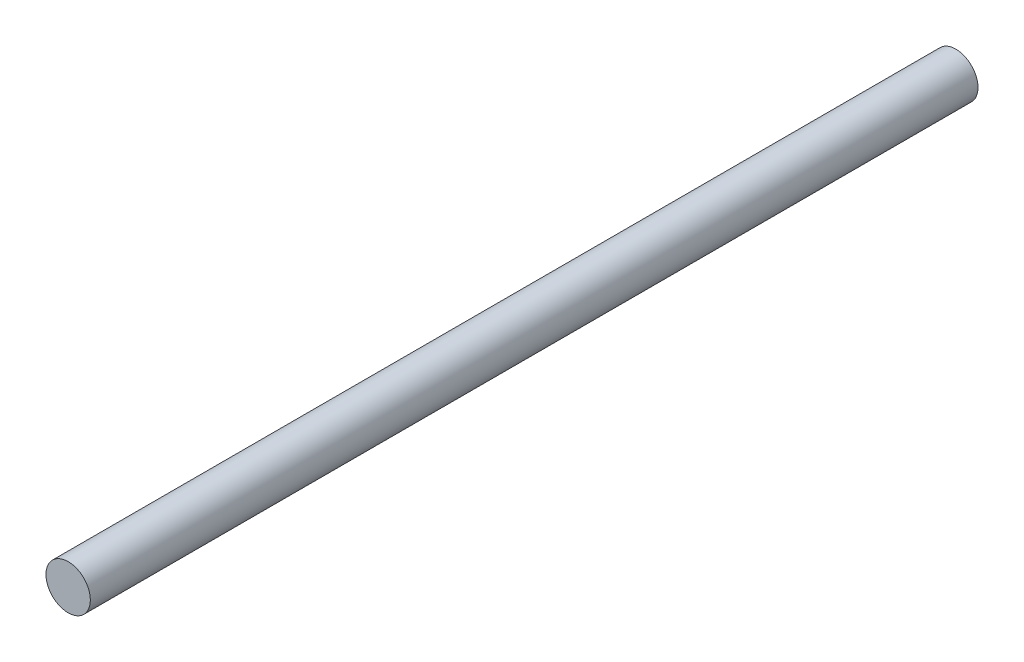
ISO-10303-21;
HEADER;
FILE_DESCRIPTION(('STEP AP214'),'2;1');
FILE_NAME('part.step','',(''),(''),'','','');
FILE_SCHEMA(('AUTOMOTIVE_DESIGN { 1 0 10303 214 1 1 1 1 }'));
ENDSEC;
DATA;
#1=APPLICATION_CONTEXT('core data for automotive mechanical design processes');
#2=APPLICATION_PROTOCOL_DEFINITION('international standard','automotive_design',2000,#1);
#3=PRODUCT_CONTEXT('',#1,'mechanical');
#4=PRODUCT('Part','Part','',(#3));
#5=PRODUCT_RELATED_PRODUCT_CATEGORY('part','',(#4));
#6=PRODUCT_DEFINITION_FORMATION('','',#4);
#7=PRODUCT_DEFINITION_CONTEXT('part definition',#1,'design');
#8=PRODUCT_DEFINITION('design','',#6,#7);
#9=PRODUCT_DEFINITION_SHAPE('','',#8);
#10=(LENGTH_UNIT() NAMED_UNIT(*) SI_UNIT(.MILLI.,.METRE.));
#11=(NAMED_UNIT(*) PLANE_ANGLE_UNIT() SI_UNIT($,.RADIAN.));
#12=(NAMED_UNIT(*) SI_UNIT($,.STERADIAN.) SOLID_ANGLE_UNIT());
#13=UNCERTAINTY_MEASURE_WITH_UNIT(LENGTH_MEASURE(1.E-05),#10,'distance_accuracy_value','');
#14=(GEOMETRIC_REPRESENTATION_CONTEXT(3) GLOBAL_UNCERTAINTY_ASSIGNED_CONTEXT((#13)) GLOBAL_UNIT_ASSIGNED_CONTEXT((#10,
#11,#12)) REPRESENTATION_CONTEXT('',''));
#15=CARTESIAN_POINT('',(0.,0.,0.));
#16=DIRECTION('',(0.,0.,1.));
#17=DIRECTION('',(1.,0.,0.));
#18=AXIS2_PLACEMENT_3D('',#15,#16,#17);
#19=CARTESIAN_POINT('',(0.,0.,127.));
#20=DIRECTION('',(0.,0.,-1.));
#21=DIRECTION('',(-1.,0.,0.));
#22=AXIS2_PLACEMENT_3D('',#19,#20,#21);
#23=CYLINDRICAL_SURFACE('',#22,3.175);
#24=CARTESIAN_POINT('',(0.,0.,127.));
#25=DIRECTION('',(0.,0.,1.));
#26=DIRECTION('',(1.,0.,0.));
#27=AXIS2_PLACEMENT_3D('',#24,#25,#26);
#28=CIRCLE('',#27,3.175);
#29=CARTESIAN_POINT('',(3.175,0.,127.));
#30=VERTEX_POINT('',#29);
#31=EDGE_CURVE('E10',#30,#30,#28,.T.);
#32=ORIENTED_EDGE('',*,*,#31,.F.);
#33=EDGE_LOOP('',(#32));
#34=FACE_BOUND('',#33,.T.);
#35=CARTESIAN_POINT('',(0.,0.,0.));
#36=DIRECTION('',(0.,0.,1.));
#37=DIRECTION('',(1.,0.,0.));
#38=AXIS2_PLACEMENT_3D('',#35,#36,#37);
#39=CIRCLE('',#38,3.175);
#40=CARTESIAN_POINT('',(3.175,0.,0.));
#41=VERTEX_POINT('',#40);
#42=EDGE_CURVE('E39',#41,#41,#39,.T.);
#43=ORIENTED_EDGE('',*,*,#42,.T.);
#44=EDGE_LOOP('',(#43));
#45=FACE_BOUND('',#44,.T.);
#46=ADVANCED_FACE('F36',(#34,#45),#23,.T.);
#47=CARTESIAN_POINT('',(0.,0.,127.));
#48=DIRECTION('',(0.,0.,1.));
#49=DIRECTION('',(1.,0.,0.));
#50=AXIS2_PLACEMENT_3D('',#47,#48,#49);
#51=PLANE('',#50);
#52=ORIENTED_EDGE('',*,*,#31,.T.);
#53=EDGE_LOOP('',(#52));
#54=FACE_BOUND('',#53,.T.);
#55=ADVANCED_FACE('F51',(#54),#51,.T.);
#56=CARTESIAN_POINT('',(0.,0.,0.));
#57=DIRECTION('',(0.,0.,1.));
#58=DIRECTION('',(1.,0.,0.));
#59=AXIS2_PLACEMENT_3D('',#56,#57,#58);
#60=PLANE('',#59);
#61=ORIENTED_EDGE('',*,*,#42,.F.);
#62=EDGE_LOOP('',(#61));
#63=FACE_BOUND('',#62,.T.);
#64=ADVANCED_FACE('F49',(#63),#60,.F.);
#65=CLOSED_SHELL('',(#46,#55,#64));
#66=MANIFOLD_SOLID_BREP('B2',#65);
#67=ADVANCED_BREP_SHAPE_REPRESENTATION('',(#18,#66),#14);
#68=SHAPE_DEFINITION_REPRESENTATION(#9,#67);
ENDSEC;
END-ISO-10303-21;
